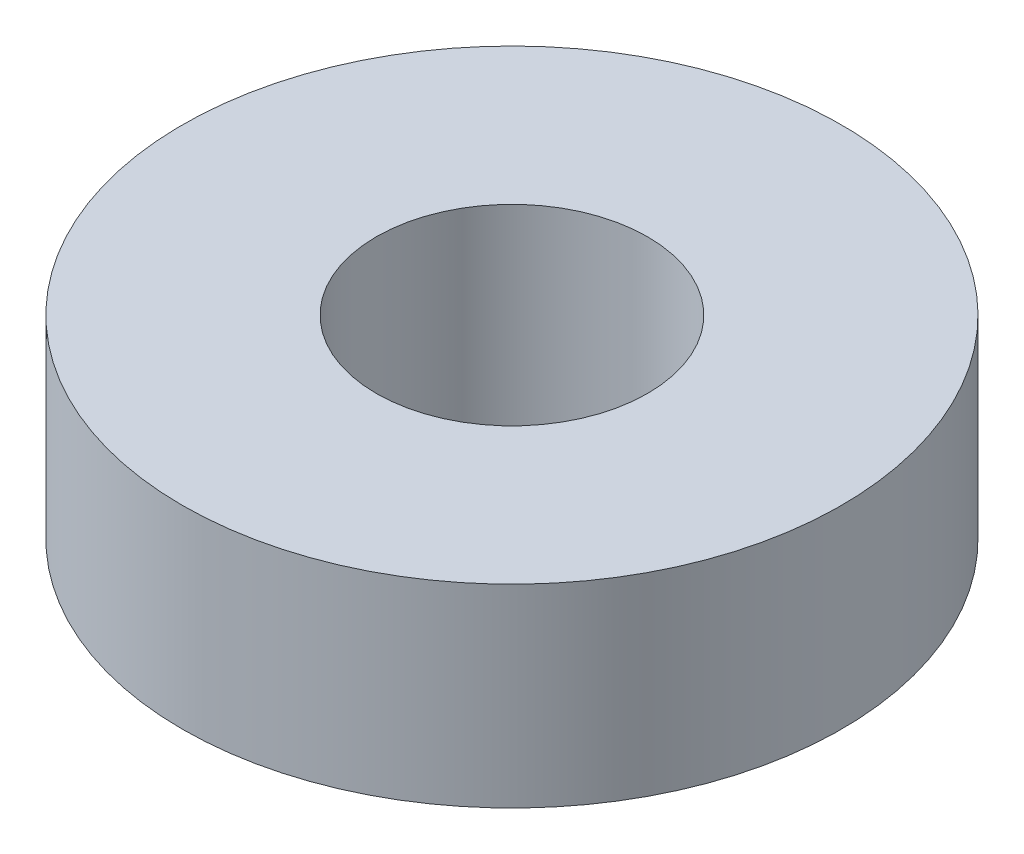
ISO-10303-21;
HEADER;
FILE_DESCRIPTION(('STEP AP214'),'2;1');
FILE_NAME('part.step','',(''),(''),'','','');
FILE_SCHEMA(('AUTOMOTIVE_DESIGN { 1 0 10303 214 1 1 1 1 }'));
ENDSEC;
DATA;
#1=APPLICATION_CONTEXT('core data for automotive mechanical design processes');
#2=APPLICATION_PROTOCOL_DEFINITION('international standard','automotive_design',2000,#1);
#3=PRODUCT_CONTEXT('',#1,'mechanical');
#4=PRODUCT('Part','Part','',(#3));
#5=PRODUCT_RELATED_PRODUCT_CATEGORY('part','',(#4));
#6=PRODUCT_DEFINITION_FORMATION('','',#4);
#7=PRODUCT_DEFINITION_CONTEXT('part definition',#1,'design');
#8=PRODUCT_DEFINITION('design','',#6,#7);
#9=PRODUCT_DEFINITION_SHAPE('','',#8);
#10=(LENGTH_UNIT() NAMED_UNIT(*) SI_UNIT(.MILLI.,.METRE.));
#11=(NAMED_UNIT(*) PLANE_ANGLE_UNIT() SI_UNIT($,.RADIAN.));
#12=(NAMED_UNIT(*) SI_UNIT($,.STERADIAN.) SOLID_ANGLE_UNIT());
#13=UNCERTAINTY_MEASURE_WITH_UNIT(LENGTH_MEASURE(1.E-05),#10,'distance_accuracy_value','');
#14=(GEOMETRIC_REPRESENTATION_CONTEXT(3) GLOBAL_UNCERTAINTY_ASSIGNED_CONTEXT((#13)) GLOBAL_UNIT_ASSIGNED_CONTEXT((#10,
#11,#12)) REPRESENTATION_CONTEXT('',''));
#15=CARTESIAN_POINT('',(0.,0.,0.));
#16=DIRECTION('',(0.,0.,1.));
#17=DIRECTION('',(1.,0.,0.));
#18=AXIS2_PLACEMENT_3D('',#15,#16,#17);
#19=CARTESIAN_POINT('',(0.,25.,0.));
#20=DIRECTION('',(0.,-1.,0.));
#21=DIRECTION('',(0.,0.,-1.));
#22=AXIS2_PLACEMENT_3D('',#19,#20,#21);
#23=CYLINDRICAL_SURFACE('',#22,42.5);
#24=CARTESIAN_POINT('',(0.,25.,0.));
#25=DIRECTION('',(0.,1.,0.));
#26=DIRECTION('',(0.,0.,1.));
#27=AXIS2_PLACEMENT_3D('',#24,#25,#26);
#28=CIRCLE('',#27,42.5);
#29=CARTESIAN_POINT('',(0.,25.,42.5));
#30=VERTEX_POINT('',#29);
#31=EDGE_CURVE('E10',#30,#30,#28,.T.);
#32=ORIENTED_EDGE('',*,*,#31,.F.);
#33=EDGE_LOOP('',(#32));
#34=FACE_BOUND('',#33,.T.);
#35=CARTESIAN_POINT('',(0.,0.,0.));
#36=DIRECTION('',(0.,1.,0.));
#37=DIRECTION('',(0.,0.,1.));
#38=AXIS2_PLACEMENT_3D('',#35,#36,#37);
#39=CIRCLE('',#38,42.5);
#40=CARTESIAN_POINT('',(0.,0.,42.5));
#41=VERTEX_POINT('',#40);
#42=EDGE_CURVE('E37',#41,#41,#39,.T.);
#43=ORIENTED_EDGE('',*,*,#42,.T.);
#44=EDGE_LOOP('',(#43));
#45=FACE_BOUND('',#44,.T.);
#46=ADVANCED_FACE('F40',(#34,#45),#23,.T.);
#47=CARTESIAN_POINT('',(0.,25.,0.));
#48=DIRECTION('',(0.,1.,0.));
#49=DIRECTION('',(0.,0.,1.));
#50=AXIS2_PLACEMENT_3D('',#47,#48,#49);
#51=PLANE('',#50);
#52=CARTESIAN_POINT('',(0.,25.,0.));
#53=DIRECTION('',(0.,1.,0.));
#54=DIRECTION('',(0.,0.,1.));
#55=AXIS2_PLACEMENT_3D('',#52,#53,#54);
#56=CIRCLE('',#55,17.5);
#57=CARTESIAN_POINT('',(0.,25.,17.5));
#58=VERTEX_POINT('',#57);
#59=EDGE_CURVE('E50',#58,#58,#56,.T.);
#60=ORIENTED_EDGE('',*,*,#59,.F.);
#61=EDGE_LOOP('',(#60));
#62=FACE_BOUND('',#61,.T.);
#63=ORIENTED_EDGE('',*,*,#31,.T.);
#64=EDGE_LOOP('',(#63));
#65=FACE_BOUND('',#64,.T.);
#66=ADVANCED_FACE('F59',(#62,#65),#51,.T.);
#67=CARTESIAN_POINT('',(0.,0.,0.));
#68=DIRECTION('',(0.,1.,0.));
#69=DIRECTION('',(0.,0.,1.));
#70=AXIS2_PLACEMENT_3D('',#67,#68,#69);
#71=PLANE('',#70);
#72=CARTESIAN_POINT('',(0.,0.,0.));
#73=DIRECTION('',(0.,1.,0.));
#74=DIRECTION('',(0.,0.,1.));
#75=AXIS2_PLACEMENT_3D('',#72,#73,#74);
#76=CIRCLE('',#75,17.5);
#77=CARTESIAN_POINT('',(0.,0.,17.5));
#78=VERTEX_POINT('',#77);
#79=EDGE_CURVE('E47',#78,#78,#76,.T.);
#80=ORIENTED_EDGE('',*,*,#79,.T.);
#81=EDGE_LOOP('',(#80));
#82=FACE_BOUND('',#81,.T.);
#83=ORIENTED_EDGE('',*,*,#42,.F.);
#84=EDGE_LOOP('',(#83));
#85=FACE_BOUND('',#84,.T.);
#86=ADVANCED_FACE('F58',(#82,#85),#71,.F.);
#87=CARTESIAN_POINT('',(0.,25.,0.));
#88=DIRECTION('',(0.,-1.,0.));
#89=DIRECTION('',(0.,0.,-1.));
#90=AXIS2_PLACEMENT_3D('',#87,#88,#89);
#91=CYLINDRICAL_SURFACE('',#90,17.5);
#92=ORIENTED_EDGE('',*,*,#59,.T.);
#93=EDGE_LOOP('',(#92));
#94=FACE_BOUND('',#93,.T.);
#95=ORIENTED_EDGE('',*,*,#79,.F.);
#96=EDGE_LOOP('',(#95));
#97=FACE_BOUND('',#96,.T.);
#98=ADVANCED_FACE('F54',(#94,#97),#91,.F.);
#99=CLOSED_SHELL('',(#46,#66,#86,#98));
#100=MANIFOLD_SOLID_BREP('B2',#99);
#101=ADVANCED_BREP_SHAPE_REPRESENTATION('',(#18,#100),#14);
#102=SHAPE_DEFINITION_REPRESENTATION(#9,#101);
ENDSEC;
END-ISO-10303-21;
